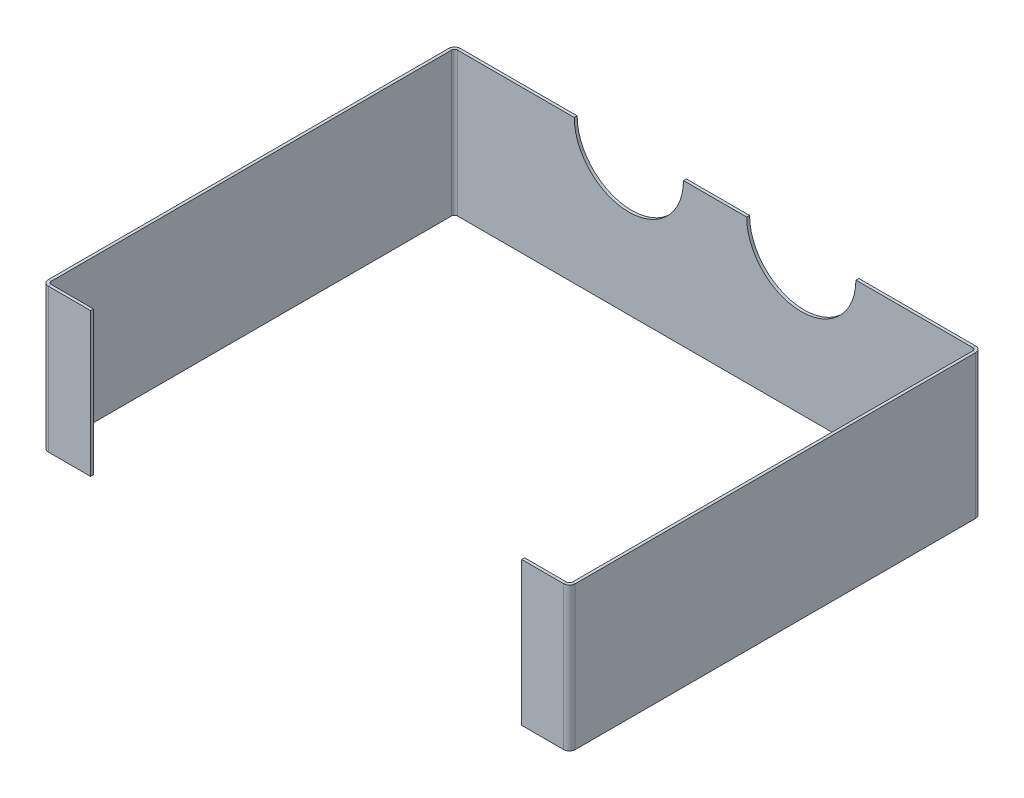
ISO-10303-21;
HEADER;
FILE_DESCRIPTION(('STEP AP214'),'2;1');
FILE_NAME('part.step','',(''),(''),'','','');
FILE_SCHEMA(('AUTOMOTIVE_DESIGN { 1 0 10303 214 1 1 1 1 }'));
ENDSEC;
DATA;
#1=APPLICATION_CONTEXT('core data for automotive mechanical design processes');
#2=APPLICATION_PROTOCOL_DEFINITION('international standard','automotive_design',2000,#1);
#3=PRODUCT_CONTEXT('',#1,'mechanical');
#4=PRODUCT('Part','Part','',(#3));
#5=PRODUCT_RELATED_PRODUCT_CATEGORY('part','',(#4));
#6=PRODUCT_DEFINITION_FORMATION('','',#4);
#7=PRODUCT_DEFINITION_CONTEXT('part definition',#1,'design');
#8=PRODUCT_DEFINITION('design','',#6,#7);
#9=PRODUCT_DEFINITION_SHAPE('','',#8);
#10=(LENGTH_UNIT() NAMED_UNIT(*) SI_UNIT(.MILLI.,.METRE.));
#11=(NAMED_UNIT(*) PLANE_ANGLE_UNIT() SI_UNIT($,.RADIAN.));
#12=(NAMED_UNIT(*) SI_UNIT($,.STERADIAN.) SOLID_ANGLE_UNIT());
#13=UNCERTAINTY_MEASURE_WITH_UNIT(LENGTH_MEASURE(1.E-05),#10,'distance_accuracy_value','');
#14=(GEOMETRIC_REPRESENTATION_CONTEXT(3) GLOBAL_UNCERTAINTY_ASSIGNED_CONTEXT((#13)) GLOBAL_UNIT_ASSIGNED_CONTEXT((#10,
#11,#12)) REPRESENTATION_CONTEXT('',''));
#15=CARTESIAN_POINT('',(0.,0.,0.));
#16=DIRECTION('',(0.,0.,1.));
#17=DIRECTION('',(1.,0.,0.));
#18=AXIS2_PLACEMENT_3D('',#15,#16,#17);
#19=CARTESIAN_POINT('',(-89.9999999999999,75.,-3.));
#20=DIRECTION('',(0.,0.,1.));
#21=DIRECTION('',(1.,0.,0.));
#22=AXIS2_PLACEMENT_3D('',#19,#20,#21);
#23=PLANE('',#22);
#24=DIRECTION('',(0.,-1.,0.));
#25=VECTOR('',#24,1.);
#26=CARTESIAN_POINT('',(269.,74.9999999999998,-2.99999999999993));
#27=LINE('',#26,#25);
#28=CARTESIAN_POINT('',(269.,74.9999999999998,-2.99999999999993));
#29=VERTEX_POINT('',#28);
#30=CARTESIAN_POINT('',(269.,-75.0000000000002,-2.99999999999994));
#31=VERTEX_POINT('',#30);
#32=EDGE_CURVE('E507',#29,#31,#27,.T.);
#33=ORIENTED_EDGE('',*,*,#32,.T.);
#34=DIRECTION('',(1.,0.,0.));
#35=VECTOR('',#34,1.);
#36=CARTESIAN_POINT('',(-275.,-75.,-3.));
#37=LINE('',#36,#35);
#38=CARTESIAN_POINT('',(-269.,-75.,-2.99999999999999));
#39=VERTEX_POINT('',#38);
#40=EDGE_CURVE('E460',#39,#31,#37,.T.);
#41=ORIENTED_EDGE('',*,*,#40,.F.);
#42=DIRECTION('',(0.,1.,0.));
#43=VECTOR('',#42,1.);
#44=CARTESIAN_POINT('',(-269.,-75.,-2.99999999999999));
#45=LINE('',#44,#43);
#46=CARTESIAN_POINT('',(-269.,75.,-2.99999999999999));
#47=VERTEX_POINT('',#46);
#48=EDGE_CURVE('E479',#39,#47,#45,.T.);
#49=ORIENTED_EDGE('',*,*,#48,.T.);
#50=DIRECTION('',(-1.,0.,0.));
#51=VECTOR('',#50,1.);
#52=CARTESIAN_POINT('',(-275.,75.,-3.));
#53=LINE('',#52,#51);
#54=CARTESIAN_POINT('',(-147.,75.,-3.));
#55=VERTEX_POINT('',#54);
#56=EDGE_CURVE('E457',#55,#47,#53,.T.);
#57=ORIENTED_EDGE('',*,*,#56,.F.);
#58=CARTESIAN_POINT('',(-89.9999999999999,75.,-3.));
#59=DIRECTION('',(0.,0.,-1.));
#60=DIRECTION('',(1.,0.,0.));
#61=AXIS2_PLACEMENT_3D('',#58,#59,#60);
#62=CIRCLE('',#61,57.);
#63=CARTESIAN_POINT('',(-32.9999999999999,75.,-3.));
#64=VERTEX_POINT('',#63);
#65=EDGE_CURVE('E454',#64,#55,#62,.T.);
#66=ORIENTED_EDGE('',*,*,#65,.F.);
#67=DIRECTION('',(-1.,0.,0.));
#68=VECTOR('',#67,1.);
#69=CARTESIAN_POINT('',(-32.9999999999999,75.,-3.));
#70=LINE('',#69,#68);
#71=CARTESIAN_POINT('',(33.0000000000002,75.,-3.));
#72=VERTEX_POINT('',#71);
#73=EDGE_CURVE('E451',#72,#64,#70,.T.);
#74=ORIENTED_EDGE('',*,*,#73,.F.);
#75=CARTESIAN_POINT('',(90.0000000000002,75.,-3.));
#76=DIRECTION('',(0.,0.,-1.));
#77=DIRECTION('',(-1.,0.,0.));
#78=AXIS2_PLACEMENT_3D('',#75,#76,#77);
#79=CIRCLE('',#78,57.);
#80=CARTESIAN_POINT('',(147.,75.,-3.));
#81=VERTEX_POINT('',#80);
#82=EDGE_CURVE('E447',#81,#72,#79,.T.);
#83=ORIENTED_EDGE('',*,*,#82,.F.);
#84=DIRECTION('',(-1.,0.,0.));
#85=VECTOR('',#84,1.);
#86=CARTESIAN_POINT('',(147.,75.,-3.));
#87=LINE('',#86,#85);
#88=EDGE_CURVE('E445',#29,#81,#87,.T.);
#89=ORIENTED_EDGE('',*,*,#88,.F.);
#90=EDGE_LOOP('',(#33,#41,#49,#57,#66,#74,#83,#89));
#91=FACE_BOUND('',#90,.T.);
#92=ADVANCED_FACE('F131',(#91),#23,.F.);
#93=CARTESIAN_POINT('',(-89.9999999999999,75.,0.));
#94=DIRECTION('',(0.,0.,1.));
#95=DIRECTION('',(1.,0.,0.));
#96=AXIS2_PLACEMENT_3D('',#93,#94,#95);
#97=PLANE('',#96);
#98=DIRECTION('',(1.,0.,0.));
#99=VECTOR('',#98,1.);
#100=CARTESIAN_POINT('',(-275.,-75.,0.));
#101=LINE('',#100,#99);
#102=CARTESIAN_POINT('',(-269.,-75.,0.));
#103=VERTEX_POINT('',#102);
#104=CARTESIAN_POINT('',(269.,-75.0000000000002,0.));
#105=VERTEX_POINT('',#104);
#106=EDGE_CURVE('E448',#103,#105,#101,.T.);
#107=ORIENTED_EDGE('',*,*,#106,.T.);
#108=DIRECTION('',(0.,-1.,0.));
#109=VECTOR('',#108,1.);
#110=CARTESIAN_POINT('',(269.,74.9999999999998,0.));
#111=LINE('',#110,#109);
#112=CARTESIAN_POINT('',(269.,74.9999999999998,0.));
#113=VERTEX_POINT('',#112);
#114=EDGE_CURVE('E512',#113,#105,#111,.T.);
#115=ORIENTED_EDGE('',*,*,#114,.F.);
#116=DIRECTION('',(-1.,0.,0.));
#117=VECTOR('',#116,1.);
#118=CARTESIAN_POINT('',(147.,75.,0.));
#119=LINE('',#118,#117);
#120=CARTESIAN_POINT('',(147.,75.,0.));
#121=VERTEX_POINT('',#120);
#122=EDGE_CURVE('E440',#113,#121,#119,.T.);
#123=ORIENTED_EDGE('',*,*,#122,.T.);
#124=CARTESIAN_POINT('',(90.0000000000002,75.,0.));
#125=DIRECTION('',(0.,0.,-1.));
#126=DIRECTION('',(-1.,0.,0.));
#127=AXIS2_PLACEMENT_3D('',#124,#125,#126);
#128=CIRCLE('',#127,57.);
#129=CARTESIAN_POINT('',(33.0000000000002,75.,0.));
#130=VERTEX_POINT('',#129);
#131=EDGE_CURVE('E465',#121,#130,#128,.T.);
#132=ORIENTED_EDGE('',*,*,#131,.T.);
#133=DIRECTION('',(-1.,0.,0.));
#134=VECTOR('',#133,1.);
#135=CARTESIAN_POINT('',(-32.9999999999999,75.,0.));
#136=LINE('',#135,#134);
#137=CARTESIAN_POINT('',(-32.9999999999999,75.,0.));
#138=VERTEX_POINT('',#137);
#139=EDGE_CURVE('E468',#130,#138,#136,.T.);
#140=ORIENTED_EDGE('',*,*,#139,.T.);
#141=CARTESIAN_POINT('',(-89.9999999999999,75.,0.));
#142=DIRECTION('',(0.,0.,-1.));
#143=DIRECTION('',(1.,0.,0.));
#144=AXIS2_PLACEMENT_3D('',#141,#142,#143);
#145=CIRCLE('',#144,57.);
#146=CARTESIAN_POINT('',(-147.,75.,0.));
#147=VERTEX_POINT('',#146);
#148=EDGE_CURVE('E471',#138,#147,#145,.T.);
#149=ORIENTED_EDGE('',*,*,#148,.T.);
#150=DIRECTION('',(-1.,0.,0.));
#151=VECTOR('',#150,1.);
#152=CARTESIAN_POINT('',(-275.,75.,0.));
#153=LINE('',#152,#151);
#154=CARTESIAN_POINT('',(-269.,75.,0.));
#155=VERTEX_POINT('',#154);
#156=EDGE_CURVE('E474',#147,#155,#153,.T.);
#157=ORIENTED_EDGE('',*,*,#156,.T.);
#158=DIRECTION('',(0.,1.,0.));
#159=VECTOR('',#158,1.);
#160=CARTESIAN_POINT('',(-269.,-75.,0.));
#161=LINE('',#160,#159);
#162=EDGE_CURVE('E490',#103,#155,#161,.T.);
#163=ORIENTED_EDGE('',*,*,#162,.F.);
#164=EDGE_LOOP('',(#107,#115,#123,#132,#140,#149,#157,#163));
#165=FACE_BOUND('',#164,.T.);
#166=ADVANCED_FACE('F563',(#165),#97,.T.);
#167=CARTESIAN_POINT('',(147.,75.,-3.));
#168=DIRECTION('',(0.,1.,0.));
#169=DIRECTION('',(0.,0.,1.));
#170=AXIS2_PLACEMENT_3D('',#167,#168,#169);
#171=PLANE('',#170);
#172=ORIENTED_EDGE('',*,*,#122,.F.);
#173=DIRECTION('',(0.,0.,-1.));
#174=VECTOR('',#173,1.);
#175=CARTESIAN_POINT('',(269.,74.9999999999998,0.));
#176=LINE('',#175,#174);
#177=EDGE_CURVE('E509',#113,#29,#176,.T.);
#178=ORIENTED_EDGE('',*,*,#177,.T.);
#179=ORIENTED_EDGE('',*,*,#88,.T.);
#180=DIRECTION('',(0.,0.,1.));
#181=VECTOR('',#180,1.);
#182=CARTESIAN_POINT('',(147.,75.,-3.));
#183=LINE('',#182,#181);
#184=EDGE_CURVE('E463',#81,#121,#183,.T.);
#185=ORIENTED_EDGE('',*,*,#184,.T.);
#186=EDGE_LOOP('',(#172,#178,#179,#185));
#187=FACE_BOUND('',#186,.T.);
#188=ADVANCED_FACE('F133',(#187),#171,.T.);
#189=CARTESIAN_POINT('',(-275.,-75.,-3.));
#190=DIRECTION('',(0.,-1.,0.));
#191=DIRECTION('',(0.,0.,-1.));
#192=AXIS2_PLACEMENT_3D('',#189,#190,#191);
#193=PLANE('',#192);
#194=DIRECTION('',(0.,0.,-1.));
#195=VECTOR('',#194,1.);
#196=CARTESIAN_POINT('',(269.,-75.0000000000002,0.));
#197=LINE('',#196,#195);
#198=EDGE_CURVE('E515',#105,#31,#197,.T.);
#199=ORIENTED_EDGE('',*,*,#198,.F.);
#200=ORIENTED_EDGE('',*,*,#106,.F.);
#201=DIRECTION('',(0.,0.,-1.));
#202=VECTOR('',#201,1.);
#203=CARTESIAN_POINT('',(-269.,-75.,0.));
#204=LINE('',#203,#202);
#205=EDGE_CURVE('E487',#103,#39,#204,.T.);
#206=ORIENTED_EDGE('',*,*,#205,.T.);
#207=ORIENTED_EDGE('',*,*,#40,.T.);
#208=EDGE_LOOP('',(#199,#200,#206,#207));
#209=FACE_BOUND('',#208,.T.);
#210=ADVANCED_FACE('F577',(#209),#193,.T.);
#211=CARTESIAN_POINT('',(-275.,75.,-3.));
#212=DIRECTION('',(0.,1.,0.));
#213=DIRECTION('',(0.,0.,1.));
#214=AXIS2_PLACEMENT_3D('',#211,#212,#213);
#215=PLANE('',#214);
#216=DIRECTION('',(0.,0.,-1.));
#217=VECTOR('',#216,1.);
#218=CARTESIAN_POINT('',(-269.,75.,0.));
#219=LINE('',#218,#217);
#220=EDGE_CURVE('E493',#155,#47,#219,.T.);
#221=ORIENTED_EDGE('',*,*,#220,.F.);
#222=ORIENTED_EDGE('',*,*,#156,.F.);
#223=DIRECTION('',(0.,0.,1.));
#224=VECTOR('',#223,1.);
#225=CARTESIAN_POINT('',(-147.,75.,-3.));
#226=LINE('',#225,#224);
#227=EDGE_CURVE('E477',#55,#147,#226,.T.);
#228=ORIENTED_EDGE('',*,*,#227,.F.);
#229=ORIENTED_EDGE('',*,*,#56,.T.);
#230=EDGE_LOOP('',(#221,#222,#228,#229));
#231=FACE_BOUND('',#230,.T.);
#232=ADVANCED_FACE('F664',(#231),#215,.T.);
#233=CARTESIAN_POINT('',(-89.9999999999999,75.,-3.));
#234=DIRECTION('',(0.,0.,1.));
#235=DIRECTION('',(1.,0.,0.));
#236=AXIS2_PLACEMENT_3D('',#233,#234,#235);
#237=CYLINDRICAL_SURFACE('',#236,57.);
#238=ORIENTED_EDGE('',*,*,#148,.F.);
#239=DIRECTION('',(0.,0.,1.));
#240=VECTOR('',#239,1.);
#241=CARTESIAN_POINT('',(-32.9999999999999,75.,-3.));
#242=LINE('',#241,#240);
#243=EDGE_CURVE('E480',#64,#138,#242,.T.);
#244=ORIENTED_EDGE('',*,*,#243,.F.);
#245=ORIENTED_EDGE('',*,*,#65,.T.);
#246=ORIENTED_EDGE('',*,*,#227,.T.);
#247=EDGE_LOOP('',(#238,#244,#245,#246));
#248=FACE_BOUND('',#247,.T.);
#249=ADVANCED_FACE('F667',(#248),#237,.F.);
#250=CARTESIAN_POINT('',(-32.9999999999999,75.,-3.));
#251=DIRECTION('',(0.,1.,0.));
#252=DIRECTION('',(0.,0.,1.));
#253=AXIS2_PLACEMENT_3D('',#250,#251,#252);
#254=PLANE('',#253);
#255=ORIENTED_EDGE('',*,*,#139,.F.);
#256=DIRECTION('',(0.,0.,1.));
#257=VECTOR('',#256,1.);
#258=CARTESIAN_POINT('',(33.0000000000002,75.,-3.));
#259=LINE('',#258,#257);
#260=EDGE_CURVE('E482',#72,#130,#259,.T.);
#261=ORIENTED_EDGE('',*,*,#260,.F.);
#262=ORIENTED_EDGE('',*,*,#73,.T.);
#263=ORIENTED_EDGE('',*,*,#243,.T.);
#264=EDGE_LOOP('',(#255,#261,#262,#263));
#265=FACE_BOUND('',#264,.T.);
#266=ADVANCED_FACE('F671',(#265),#254,.T.);
#267=CARTESIAN_POINT('',(90.0000000000002,75.,-3.));
#268=DIRECTION('',(0.,0.,1.));
#269=DIRECTION('',(1.,0.,0.));
#270=AXIS2_PLACEMENT_3D('',#267,#268,#269);
#271=CYLINDRICAL_SURFACE('',#270,57.);
#272=ORIENTED_EDGE('',*,*,#131,.F.);
#273=ORIENTED_EDGE('',*,*,#184,.F.);
#274=ORIENTED_EDGE('',*,*,#82,.T.);
#275=ORIENTED_EDGE('',*,*,#260,.T.);
#276=EDGE_LOOP('',(#272,#273,#274,#275));
#277=FACE_BOUND('',#276,.T.);
#278=ADVANCED_FACE('F674',(#277),#271,.F.);
#279=CARTESIAN_POINT('',(-269.,75.,3.00000000000001));
#280=DIRECTION('',(0.,1.,0.));
#281=DIRECTION('',(0.,0.,1.));
#282=AXIS2_PLACEMENT_3D('',#279,#280,#281);
#283=PLANE('',#282);
#284=DIRECTION('',(-1.,0.,0.));
#285=VECTOR('',#284,1.);
#286=CARTESIAN_POINT('',(-275.,75.,3.00000000000006));
#287=LINE('',#286,#285);
#288=CARTESIAN_POINT('',(-272.,75.,3.00000000000006));
#289=VERTEX_POINT('',#288);
#290=CARTESIAN_POINT('',(-275.,75.,3.00000000000002));
#291=VERTEX_POINT('',#290);
#292=EDGE_CURVE('E413',#289,#291,#287,.T.);
#293=ORIENTED_EDGE('',*,*,#292,.F.);
#294=CARTESIAN_POINT('',(-269.,75.,3.00000000000001));
#295=DIRECTION('',(0.,1.,0.));
#296=DIRECTION('',(0.,0.,1.));
#297=AXIS2_PLACEMENT_3D('',#294,#295,#296);
#298=CIRCLE('',#297,3.);
#299=EDGE_CURVE('E415',#289,#155,#298,.F.);
#300=ORIENTED_EDGE('',*,*,#299,.T.);
#301=ORIENTED_EDGE('',*,*,#220,.T.);
#302=CARTESIAN_POINT('',(-269.,75.,3.00000000000001));
#303=DIRECTION('',(0.,-1.,0.));
#304=DIRECTION('',(0.,0.,-1.));
#305=AXIS2_PLACEMENT_3D('',#302,#303,#304);
#306=CIRCLE('',#305,6.);
#307=EDGE_CURVE('E433',#291,#47,#306,.T.);
#308=ORIENTED_EDGE('',*,*,#307,.F.);
#309=EDGE_LOOP('',(#293,#300,#301,#308));
#310=FACE_BOUND('',#309,.T.);
#311=ADVANCED_FACE('F602',(#310),#283,.T.);
#312=CARTESIAN_POINT('',(-269.,-75.,3.00000000000001));
#313=DIRECTION('',(0.,-1.,0.));
#314=DIRECTION('',(0.,0.,-1.));
#315=AXIS2_PLACEMENT_3D('',#312,#313,#314);
#316=PLANE('',#315);
#317=CARTESIAN_POINT('',(-269.,-75.,3.00000000000001));
#318=DIRECTION('',(0.,1.,0.));
#319=DIRECTION('',(0.,0.,1.));
#320=AXIS2_PLACEMENT_3D('',#317,#318,#319);
#321=CIRCLE('',#320,3.);
#322=CARTESIAN_POINT('',(-272.,-75.,3.00000000000006));
#323=VERTEX_POINT('',#322);
#324=EDGE_CURVE('E437',#103,#323,#321,.T.);
#325=ORIENTED_EDGE('',*,*,#324,.T.);
#326=DIRECTION('',(-1.,0.,0.));
#327=VECTOR('',#326,1.);
#328=CARTESIAN_POINT('',(-272.,-75.,3.00000000000006));
#329=LINE('',#328,#327);
#330=CARTESIAN_POINT('',(-275.,-75.,3.00000000000006));
#331=VERTEX_POINT('',#330);
#332=EDGE_CURVE('E425',#323,#331,#329,.T.);
#333=ORIENTED_EDGE('',*,*,#332,.T.);
#334=CARTESIAN_POINT('',(-269.,-75.,3.00000000000001));
#335=DIRECTION('',(0.,1.,0.));
#336=DIRECTION('',(0.,0.,1.));
#337=AXIS2_PLACEMENT_3D('',#334,#335,#336);
#338=CIRCLE('',#337,6.);
#339=EDGE_CURVE('E436',#39,#331,#338,.T.);
#340=ORIENTED_EDGE('',*,*,#339,.F.);
#341=ORIENTED_EDGE('',*,*,#205,.F.);
#342=EDGE_LOOP('',(#325,#333,#340,#341));
#343=FACE_BOUND('',#342,.T.);
#344=ADVANCED_FACE('F587',(#343),#316,.T.);
#345=CARTESIAN_POINT('',(-269.,-150.196420970276,3.00000000000001));
#346=DIRECTION('',(0.,1.,0.));
#347=DIRECTION('',(0.,0.,1.));
#348=AXIS2_PLACEMENT_3D('',#345,#346,#347);
#349=CYLINDRICAL_SURFACE('',#348,6.);
#350=ORIENTED_EDGE('',*,*,#48,.F.);
#351=ORIENTED_EDGE('',*,*,#339,.T.);
#352=DIRECTION('',(0.,1.,0.));
#353=VECTOR('',#352,1.);
#354=CARTESIAN_POINT('',(-275.,75.,3.00000000000006));
#355=LINE('',#354,#353);
#356=EDGE_CURVE('E408',#331,#291,#355,.T.);
#357=ORIENTED_EDGE('',*,*,#356,.T.);
#358=ORIENTED_EDGE('',*,*,#307,.T.);
#359=EDGE_LOOP('',(#350,#351,#357,#358));
#360=FACE_BOUND('',#359,.T.);
#361=ADVANCED_FACE('F584',(#360),#349,.T.);
#362=CARTESIAN_POINT('',(-269.,-150.196420970276,3.00000000000001));
#363=DIRECTION('',(0.,1.,0.));
#364=DIRECTION('',(0.,0.,1.));
#365=AXIS2_PLACEMENT_3D('',#362,#363,#364);
#366=CYLINDRICAL_SURFACE('',#365,3.);
#367=ORIENTED_EDGE('',*,*,#162,.T.);
#368=ORIENTED_EDGE('',*,*,#299,.F.);
#369=DIRECTION('',(0.,-1.,0.));
#370=VECTOR('',#369,1.);
#371=CARTESIAN_POINT('',(-272.,75.,3.00000000000006));
#372=LINE('',#371,#370);
#373=EDGE_CURVE('E428',#289,#323,#372,.T.);
#374=ORIENTED_EDGE('',*,*,#373,.T.);
#375=ORIENTED_EDGE('',*,*,#324,.F.);
#376=EDGE_LOOP('',(#367,#368,#374,#375));
#377=FACE_BOUND('',#376,.T.);
#378=ADVANCED_FACE('F596',(#377),#366,.F.);
#379=CARTESIAN_POINT('',(-275.,0.,-9.43689570931383E-13));
#380=DIRECTION('',(1.,0.,0.));
#381=DIRECTION('',(0.,0.,-1.));
#382=AXIS2_PLACEMENT_3D('',#379,#380,#381);
#383=PLANE('',#382);
#384=DIRECTION('',(0.,1.,0.));
#385=VECTOR('',#384,1.);
#386=CARTESIAN_POINT('',(-275.000000000001,-75.,421.));
#387=LINE('',#386,#385);
#388=CARTESIAN_POINT('',(-275.000000000001,-75.,421.));
#389=VERTEX_POINT('',#388);
#390=CARTESIAN_POINT('',(-275.000000000001,75.,421.));
#391=VERTEX_POINT('',#390);
#392=EDGE_CURVE('E496',#389,#391,#387,.T.);
#393=ORIENTED_EDGE('',*,*,#392,.T.);
#394=DIRECTION('',(0.,0.,-1.));
#395=VECTOR('',#394,1.);
#396=CARTESIAN_POINT('',(-275.,75.,-9.43689570931383E-13));
#397=LINE('',#396,#395);
#398=EDGE_CURVE('E422',#391,#291,#397,.T.);
#399=ORIENTED_EDGE('',*,*,#398,.T.);
#400=ORIENTED_EDGE('',*,*,#356,.F.);
#401=DIRECTION('',(0.,0.,1.));
#402=VECTOR('',#401,1.);
#403=CARTESIAN_POINT('',(-275.,-75.,-9.43689570931383E-13));
#404=LINE('',#403,#402);
#405=EDGE_CURVE('E420',#331,#389,#404,.T.);
#406=ORIENTED_EDGE('',*,*,#405,.T.);
#407=EDGE_LOOP('',(#393,#399,#400,#406));
#408=FACE_BOUND('',#407,.T.);
#409=ADVANCED_FACE('F607',(#408),#383,.F.);
#410=CARTESIAN_POINT('',(-275.000000000001,-75.,427.));
#411=DIRECTION('',(0.,1.,0.));
#412=DIRECTION('',(0.,0.,1.));
#413=AXIS2_PLACEMENT_3D('',#410,#411,#412);
#414=PLANE('',#413);
#415=DIRECTION('',(-1.,0.,0.));
#416=VECTOR('',#415,1.);
#417=CARTESIAN_POINT('',(-272.000000000001,-75.,421.));
#418=LINE('',#417,#416);
#419=CARTESIAN_POINT('',(-272.000000000001,-75.,421.));
#420=VERTEX_POINT('',#419);
#421=EDGE_CURVE('E498',#420,#389,#418,.T.);
#422=ORIENTED_EDGE('',*,*,#421,.T.);
#423=ORIENTED_EDGE('',*,*,#405,.F.);
#424=ORIENTED_EDGE('',*,*,#332,.F.);
#425=DIRECTION('',(0.,0.,-1.));
#426=VECTOR('',#425,1.);
#427=CARTESIAN_POINT('',(-272.000000000001,-75.,427.));
#428=LINE('',#427,#426);
#429=EDGE_CURVE('E418',#323,#420,#428,.F.);
#430=ORIENTED_EDGE('',*,*,#429,.T.);
#431=EDGE_LOOP('',(#422,#423,#424,#430));
#432=FACE_BOUND('',#431,.T.);
#433=ADVANCED_FACE('F591',(#432),#414,.F.);
#434=CARTESIAN_POINT('',(-272.,0.,-8.88178419700125E-13));
#435=DIRECTION('',(1.,0.,0.));
#436=DIRECTION('',(0.,0.,-1.));
#437=AXIS2_PLACEMENT_3D('',#434,#435,#436);
#438=PLANE('',#437);
#439=DIRECTION('',(0.,0.,1.));
#440=VECTOR('',#439,1.);
#441=CARTESIAN_POINT('',(-272.,75.,0.));
#442=LINE('',#441,#440);
#443=CARTESIAN_POINT('',(-272.000000000001,75.,421.));
#444=VERTEX_POINT('',#443);
#445=EDGE_CURVE('E416',#444,#289,#442,.F.);
#446=ORIENTED_EDGE('',*,*,#445,.F.);
#447=DIRECTION('',(0.,1.,0.));
#448=VECTOR('',#447,1.);
#449=CARTESIAN_POINT('',(-272.000000000001,-75.,421.));
#450=LINE('',#449,#448);
#451=EDGE_CURVE('E501',#420,#444,#450,.T.);
#452=ORIENTED_EDGE('',*,*,#451,.F.);
#453=ORIENTED_EDGE('',*,*,#429,.F.);
#454=ORIENTED_EDGE('',*,*,#373,.F.);
#455=EDGE_LOOP('',(#446,#452,#453,#454));
#456=FACE_BOUND('',#455,.T.);
#457=ADVANCED_FACE('F599',(#456),#438,.T.);
#458=CARTESIAN_POINT('',(-275.,75.,0.));
#459=DIRECTION('',(0.,-1.,0.));
#460=DIRECTION('',(0.,0.,-1.));
#461=AXIS2_PLACEMENT_3D('',#458,#459,#460);
#462=PLANE('',#461);
#463=DIRECTION('',(-1.,0.,0.));
#464=VECTOR('',#463,1.);
#465=CARTESIAN_POINT('',(-272.000000000001,75.,421.));
#466=LINE('',#465,#464);
#467=EDGE_CURVE('E504',#444,#391,#466,.T.);
#468=ORIENTED_EDGE('',*,*,#467,.F.);
#469=ORIENTED_EDGE('',*,*,#445,.T.);
#470=ORIENTED_EDGE('',*,*,#292,.T.);
#471=ORIENTED_EDGE('',*,*,#398,.F.);
#472=EDGE_LOOP('',(#468,#469,#470,#471));
#473=FACE_BOUND('',#472,.T.);
#474=ADVANCED_FACE('F605',(#473),#462,.F.);
#475=CARTESIAN_POINT('',(-269.000000000001,75.,421.));
#476=DIRECTION('',(0.,1.,0.));
#477=DIRECTION('',(0.,0.,1.));
#478=AXIS2_PLACEMENT_3D('',#475,#476,#477);
#479=PLANE('',#478);
#480=DIRECTION('',(0.,0.,1.));
#481=VECTOR('',#480,1.);
#482=CARTESIAN_POINT('',(-269.000000000001,75.,427.));
#483=LINE('',#482,#481);
#484=CARTESIAN_POINT('',(-269.000000000001,75.,424.));
#485=VERTEX_POINT('',#484);
#486=CARTESIAN_POINT('',(-269.000000000001,75.,427.));
#487=VERTEX_POINT('',#486);
#488=EDGE_CURVE('E377',#485,#487,#483,.T.);
#489=ORIENTED_EDGE('',*,*,#488,.F.);
#490=CARTESIAN_POINT('',(-269.000000000001,75.,421.));
#491=DIRECTION('',(0.,1.,0.));
#492=DIRECTION('',(0.,0.,1.));
#493=AXIS2_PLACEMENT_3D('',#490,#491,#492);
#494=CIRCLE('',#493,3.);
#495=EDGE_CURVE('E373',#485,#444,#494,.F.);
#496=ORIENTED_EDGE('',*,*,#495,.T.);
#497=ORIENTED_EDGE('',*,*,#467,.T.);
#498=CARTESIAN_POINT('',(-269.000000000001,75.,421.));
#499=DIRECTION('',(0.,-1.,0.));
#500=DIRECTION('',(0.,0.,-1.));
#501=AXIS2_PLACEMENT_3D('',#498,#499,#500);
#502=CIRCLE('',#501,6.00000000000001);
#503=EDGE_CURVE('E401',#487,#391,#502,.T.);
#504=ORIENTED_EDGE('',*,*,#503,.F.);
#505=EDGE_LOOP('',(#489,#496,#497,#504));
#506=FACE_BOUND('',#505,.T.);
#507=ADVANCED_FACE('F632',(#506),#479,.T.);
#508=CARTESIAN_POINT('',(-269.000000000001,-75.,421.));
#509=DIRECTION('',(0.,-1.,0.));
#510=DIRECTION('',(0.,0.,-1.));
#511=AXIS2_PLACEMENT_3D('',#508,#509,#510);
#512=PLANE('',#511);
#513=CARTESIAN_POINT('',(-269.000000000001,-75.,421.));
#514=DIRECTION('',(0.,1.,0.));
#515=DIRECTION('',(0.,0.,1.));
#516=AXIS2_PLACEMENT_3D('',#513,#514,#515);
#517=CIRCLE('',#516,3.);
#518=CARTESIAN_POINT('',(-269.000000000001,-75.,424.));
#519=VERTEX_POINT('',#518);
#520=EDGE_CURVE('E405',#420,#519,#517,.T.);
#521=ORIENTED_EDGE('',*,*,#520,.T.);
#522=DIRECTION('',(0.,0.,1.));
#523=VECTOR('',#522,1.);
#524=CARTESIAN_POINT('',(-269.000000000001,-75.,424.));
#525=LINE('',#524,#523);
#526=CARTESIAN_POINT('',(-269.000000000001,-75.,427.));
#527=VERTEX_POINT('',#526);
#528=EDGE_CURVE('E393',#519,#527,#525,.T.);
#529=ORIENTED_EDGE('',*,*,#528,.T.);
#530=CARTESIAN_POINT('',(-269.000000000001,-75.,421.));
#531=DIRECTION('',(0.,1.,0.));
#532=DIRECTION('',(0.,0.,1.));
#533=AXIS2_PLACEMENT_3D('',#530,#531,#532);
#534=CIRCLE('',#533,6.00000000000001);
#535=EDGE_CURVE('E404',#389,#527,#534,.T.);
#536=ORIENTED_EDGE('',*,*,#535,.F.);
#537=ORIENTED_EDGE('',*,*,#421,.F.);
#538=EDGE_LOOP('',(#521,#529,#536,#537));
#539=FACE_BOUND('',#538,.T.);
#540=ADVANCED_FACE('F615',(#539),#512,.T.);
#541=CARTESIAN_POINT('',(-269.000000000001,-150.196420970276,421.));
#542=DIRECTION('',(0.,1.,0.));
#543=DIRECTION('',(0.,0.,1.));
#544=AXIS2_PLACEMENT_3D('',#541,#542,#543);
#545=CYLINDRICAL_SURFACE('',#544,6.);
#546=ORIENTED_EDGE('',*,*,#392,.F.);
#547=ORIENTED_EDGE('',*,*,#535,.T.);
#548=DIRECTION('',(0.,1.,0.));
#549=VECTOR('',#548,1.);
#550=CARTESIAN_POINT('',(-269.000000000001,75.,427.));
#551=LINE('',#550,#549);
#552=EDGE_CURVE('E366',#527,#487,#551,.T.);
#553=ORIENTED_EDGE('',*,*,#552,.T.);
#554=ORIENTED_EDGE('',*,*,#503,.T.);
#555=EDGE_LOOP('',(#546,#547,#553,#554));
#556=FACE_BOUND('',#555,.T.);
#557=ADVANCED_FACE('F611',(#556),#545,.T.);
#558=CARTESIAN_POINT('',(-269.000000000001,-150.196420970276,421.));
#559=DIRECTION('',(0.,1.,0.));
#560=DIRECTION('',(0.,0.,1.));
#561=AXIS2_PLACEMENT_3D('',#558,#559,#560);
#562=CYLINDRICAL_SURFACE('',#561,3.);
#563=ORIENTED_EDGE('',*,*,#451,.T.);
#564=ORIENTED_EDGE('',*,*,#495,.F.);
#565=DIRECTION('',(0.,-1.,0.));
#566=VECTOR('',#565,1.);
#567=CARTESIAN_POINT('',(-269.000000000001,75.,424.));
#568=LINE('',#567,#566);
#569=EDGE_CURVE('E396',#485,#519,#568,.T.);
#570=ORIENTED_EDGE('',*,*,#569,.T.);
#571=ORIENTED_EDGE('',*,*,#520,.F.);
#572=EDGE_LOOP('',(#563,#564,#570,#571));
#573=FACE_BOUND('',#572,.T.);
#574=ADVANCED_FACE('F626',(#573),#562,.F.);
#575=CARTESIAN_POINT('',(-225.000000000002,75.,427.));
#576=DIRECTION('',(-1.,0.,0.));
#577=DIRECTION('',(0.,0.,1.));
#578=AXIS2_PLACEMENT_3D('',#575,#576,#577);
#579=PLANE('',#578);
#580=DIRECTION('',(0.,-1.,0.));
#581=VECTOR('',#580,1.);
#582=CARTESIAN_POINT('',(-225.000000000001,75.,424.));
#583=LINE('',#582,#581);
#584=CARTESIAN_POINT('',(-225.000000000001,-75.,424.));
#585=VERTEX_POINT('',#584);
#586=CARTESIAN_POINT('',(-225.000000000001,75.,424.));
#587=VERTEX_POINT('',#586);
#588=EDGE_CURVE('E391',#585,#587,#583,.F.);
#589=ORIENTED_EDGE('',*,*,#588,.T.);
#590=DIRECTION('',(0.,0.,-1.));
#591=VECTOR('',#590,1.);
#592=CARTESIAN_POINT('',(-225.000000000002,75.,427.));
#593=LINE('',#592,#591);
#594=CARTESIAN_POINT('',(-225.000000000002,75.,427.));
#595=VERTEX_POINT('',#594);
#596=EDGE_CURVE('E374',#595,#587,#593,.T.);
#597=ORIENTED_EDGE('',*,*,#596,.F.);
#598=DIRECTION('',(0.,1.,0.));
#599=VECTOR('',#598,1.);
#600=CARTESIAN_POINT('',(-225.000000000002,0.,427.));
#601=LINE('',#600,#599);
#602=CARTESIAN_POINT('',(-225.000000000002,-75.,427.));
#603=VERTEX_POINT('',#602);
#604=EDGE_CURVE('E384',#603,#595,#601,.T.);
#605=ORIENTED_EDGE('',*,*,#604,.F.);
#606=DIRECTION('',(0.,0.,-1.));
#607=VECTOR('',#606,1.);
#608=CARTESIAN_POINT('',(-225.000000000002,-75.,427.));
#609=LINE('',#608,#607);
#610=EDGE_CURVE('E388',#603,#585,#609,.T.);
#611=ORIENTED_EDGE('',*,*,#610,.T.);
#612=EDGE_LOOP('',(#589,#597,#605,#611));
#613=FACE_BOUND('',#612,.T.);
#614=ADVANCED_FACE('F641',(#613),#579,.F.);
#615=CARTESIAN_POINT('',(-3.10862446895044E-12,0.,427.000000000002));
#616=DIRECTION('',(0.,0.,-1.));
#617=DIRECTION('',(-1.,0.,0.));
#618=AXIS2_PLACEMENT_3D('',#615,#616,#617);
#619=PLANE('',#618);
#620=ORIENTED_EDGE('',*,*,#552,.F.);
#621=DIRECTION('',(1.,0.,0.));
#622=VECTOR('',#621,1.);
#623=CARTESIAN_POINT('',(-3.10862446895044E-12,-75.,427.000000000002));
#624=LINE('',#623,#622);
#625=EDGE_CURVE('E386',#527,#603,#624,.T.);
#626=ORIENTED_EDGE('',*,*,#625,.T.);
#627=ORIENTED_EDGE('',*,*,#604,.T.);
#628=DIRECTION('',(-1.,0.,0.));
#629=VECTOR('',#628,1.);
#630=CARTESIAN_POINT('',(-3.10862446895044E-12,75.,427.000000000002));
#631=LINE('',#630,#629);
#632=EDGE_CURVE('E381',#595,#487,#631,.T.);
#633=ORIENTED_EDGE('',*,*,#632,.T.);
#634=EDGE_LOOP('',(#620,#626,#627,#633));
#635=FACE_BOUND('',#634,.T.);
#636=ADVANCED_FACE('F637',(#635),#619,.F.);
#637=CARTESIAN_POINT('',(-225.000000000002,-75.,427.));
#638=DIRECTION('',(0.,1.,0.));
#639=DIRECTION('',(0.,0.,1.));
#640=AXIS2_PLACEMENT_3D('',#637,#638,#639);
#641=PLANE('',#640);
#642=ORIENTED_EDGE('',*,*,#528,.F.);
#643=DIRECTION('',(-1.,0.,0.));
#644=VECTOR('',#643,1.);
#645=CARTESIAN_POINT('',(-225.000000000001,-75.,424.));
#646=LINE('',#645,#644);
#647=EDGE_CURVE('E379',#519,#585,#646,.F.);
#648=ORIENTED_EDGE('',*,*,#647,.T.);
#649=ORIENTED_EDGE('',*,*,#610,.F.);
#650=ORIENTED_EDGE('',*,*,#625,.F.);
#651=EDGE_LOOP('',(#642,#648,#649,#650));
#652=FACE_BOUND('',#651,.T.);
#653=ADVANCED_FACE('F620',(#652),#641,.F.);
#654=CARTESIAN_POINT('',(-2.88657986402541E-12,0.,424.000000000002));
#655=DIRECTION('',(0.,0.,-1.));
#656=DIRECTION('',(-1.,0.,0.));
#657=AXIS2_PLACEMENT_3D('',#654,#655,#656);
#658=PLANE('',#657);
#659=ORIENTED_EDGE('',*,*,#647,.F.);
#660=ORIENTED_EDGE('',*,*,#569,.F.);
#661=DIRECTION('',(1.,0.,0.));
#662=VECTOR('',#661,1.);
#663=CARTESIAN_POINT('',(-272.000000000001,75.,424.));
#664=LINE('',#663,#662);
#665=EDGE_CURVE('E371',#587,#485,#664,.F.);
#666=ORIENTED_EDGE('',*,*,#665,.F.);
#667=ORIENTED_EDGE('',*,*,#588,.F.);
#668=EDGE_LOOP('',(#659,#660,#666,#667));
#669=FACE_BOUND('',#668,.T.);
#670=ADVANCED_FACE('F630',(#669),#658,.T.);
#671=CARTESIAN_POINT('',(-272.000000000001,75.,427.));
#672=DIRECTION('',(0.,-1.,0.));
#673=DIRECTION('',(0.,0.,-1.));
#674=AXIS2_PLACEMENT_3D('',#671,#672,#673);
#675=PLANE('',#674);
#676=ORIENTED_EDGE('',*,*,#488,.T.);
#677=ORIENTED_EDGE('',*,*,#632,.F.);
#678=ORIENTED_EDGE('',*,*,#596,.T.);
#679=ORIENTED_EDGE('',*,*,#665,.T.);
#680=EDGE_LOOP('',(#676,#677,#678,#679));
#681=FACE_BOUND('',#680,.T.);
#682=ADVANCED_FACE('F635',(#681),#675,.F.);
#683=CARTESIAN_POINT('',(269.,-75.0000000000002,3.00000000000007));
#684=DIRECTION('',(0.,-1.,0.));
#685=DIRECTION('',(0.,0.,-1.));
#686=AXIS2_PLACEMENT_3D('',#683,#684,#685);
#687=PLANE('',#686);
#688=DIRECTION('',(1.,0.,0.));
#689=VECTOR('',#688,1.);
#690=CARTESIAN_POINT('',(275.,-75.0000000000002,3.00000000000011));
#691=LINE('',#690,#689);
#692=CARTESIAN_POINT('',(272.,-75.0000000000002,3.00000000000011));
#693=VERTEX_POINT('',#692);
#694=CARTESIAN_POINT('',(275.,-75.0000000000002,3.00000000000007));
#695=VERTEX_POINT('',#694);
#696=EDGE_CURVE('E345',#693,#695,#691,.T.);
#697=ORIENTED_EDGE('',*,*,#696,.F.);
#698=CARTESIAN_POINT('',(269.,-75.0000000000002,3.00000000000007));
#699=DIRECTION('',(0.,-1.,0.));
#700=DIRECTION('',(0.,0.,-1.));
#701=AXIS2_PLACEMENT_3D('',#698,#699,#700);
#702=CIRCLE('',#701,3.);
#703=EDGE_CURVE('E344',#693,#105,#702,.F.);
#704=ORIENTED_EDGE('',*,*,#703,.T.);
#705=ORIENTED_EDGE('',*,*,#198,.T.);
#706=CARTESIAN_POINT('',(269.,-75.0000000000002,3.00000000000007));
#707=DIRECTION('',(0.,1.,0.));
#708=DIRECTION('',(0.,0.,1.));
#709=AXIS2_PLACEMENT_3D('',#706,#707,#708);
#710=CIRCLE('',#709,6.);
#711=EDGE_CURVE('E359',#695,#31,#710,.T.);
#712=ORIENTED_EDGE('',*,*,#711,.F.);
#713=EDGE_LOOP('',(#697,#704,#705,#712));
#714=FACE_BOUND('',#713,.T.);
#715=ADVANCED_FACE('F556',(#714),#687,.T.);
#716=CARTESIAN_POINT('',(269.,74.9999999999998,3.00000000000007));
#717=DIRECTION('',(0.,1.,0.));
#718=DIRECTION('',(0.,0.,1.));
#719=AXIS2_PLACEMENT_3D('',#716,#717,#718);
#720=PLANE('',#719);
#721=CARTESIAN_POINT('',(269.,74.9999999999998,3.00000000000007));
#722=DIRECTION('',(0.,-1.,0.));
#723=DIRECTION('',(0.,0.,-1.));
#724=AXIS2_PLACEMENT_3D('',#721,#722,#723);
#725=CIRCLE('',#724,3.);
#726=CARTESIAN_POINT('',(272.,74.9999999999998,3.00000000000011));
#727=VERTEX_POINT('',#726);
#728=EDGE_CURVE('E363',#113,#727,#725,.T.);
#729=ORIENTED_EDGE('',*,*,#728,.T.);
#730=DIRECTION('',(1.,0.,0.));
#731=VECTOR('',#730,1.);
#732=CARTESIAN_POINT('',(272.,74.9999999999998,3.00000000000011));
#733=LINE('',#732,#731);
#734=CARTESIAN_POINT('',(275.,74.9999999999998,3.00000000000011));
#735=VERTEX_POINT('',#734);
#736=EDGE_CURVE('E351',#727,#735,#733,.T.);
#737=ORIENTED_EDGE('',*,*,#736,.T.);
#738=CARTESIAN_POINT('',(269.,74.9999999999998,3.00000000000007));
#739=DIRECTION('',(0.,-1.,0.));
#740=DIRECTION('',(0.,0.,-1.));
#741=AXIS2_PLACEMENT_3D('',#738,#739,#740);
#742=CIRCLE('',#741,6.);
#743=EDGE_CURVE('E362',#29,#735,#742,.T.);
#744=ORIENTED_EDGE('',*,*,#743,.F.);
#745=ORIENTED_EDGE('',*,*,#177,.F.);
#746=EDGE_LOOP('',(#729,#737,#744,#745));
#747=FACE_BOUND('',#746,.T.);
#748=ADVANCED_FACE('F568',(#747),#720,.T.);
#749=CARTESIAN_POINT('',(269.,150.196420970276,3.00000000000007));
#750=DIRECTION('',(0.,-1.,0.));
#751=DIRECTION('',(0.,0.,-1.));
#752=AXIS2_PLACEMENT_3D('',#749,#750,#751);
#753=CYLINDRICAL_SURFACE('',#752,6.);
#754=ORIENTED_EDGE('',*,*,#32,.F.);
#755=ORIENTED_EDGE('',*,*,#743,.T.);
#756=DIRECTION('',(0.,-1.,0.));
#757=VECTOR('',#756,1.);
#758=CARTESIAN_POINT('',(275.,-75.0000000000002,3.00000000000011));
#759=LINE('',#758,#757);
#760=EDGE_CURVE('E336',#735,#695,#759,.T.);
#761=ORIENTED_EDGE('',*,*,#760,.T.);
#762=ORIENTED_EDGE('',*,*,#711,.T.);
#763=EDGE_LOOP('',(#754,#755,#761,#762));
#764=FACE_BOUND('',#763,.T.);
#765=ADVANCED_FACE('F573',(#764),#753,.T.);
#766=CARTESIAN_POINT('',(269.,150.196420970276,3.00000000000007));
#767=DIRECTION('',(0.,-1.,0.));
#768=DIRECTION('',(0.,0.,-1.));
#769=AXIS2_PLACEMENT_3D('',#766,#767,#768);
#770=CYLINDRICAL_SURFACE('',#769,3.);
#771=ORIENTED_EDGE('',*,*,#114,.T.);
#772=ORIENTED_EDGE('',*,*,#703,.F.);
#773=DIRECTION('',(0.,1.,0.));
#774=VECTOR('',#773,1.);
#775=CARTESIAN_POINT('',(272.,-75.0000000000002,3.00000000000011));
#776=LINE('',#775,#774);
#777=EDGE_CURVE('E354',#693,#727,#776,.T.);
#778=ORIENTED_EDGE('',*,*,#777,.T.);
#779=ORIENTED_EDGE('',*,*,#728,.F.);
#780=EDGE_LOOP('',(#771,#772,#778,#779));
#781=FACE_BOUND('',#780,.T.);
#782=ADVANCED_FACE('F558',(#781),#770,.F.);
#783=CARTESIAN_POINT('',(275.,-2.05761333897196E-13,-8.88178419700125E-13));
#784=DIRECTION('',(-1.,0.,0.));
#785=DIRECTION('',(0.,0.,-1.));
#786=AXIS2_PLACEMENT_3D('',#783,#784,#785);
#787=PLANE('',#786);
#788=DIRECTION('',(0.,-1.,0.));
#789=VECTOR('',#788,1.);
#790=CARTESIAN_POINT('',(275.000000000001,74.9999999999998,421.));
#791=LINE('',#790,#789);
#792=CARTESIAN_POINT('',(275.000000000001,74.9999999999998,421.));
#793=VERTEX_POINT('',#792);
#794=CARTESIAN_POINT('',(275.000000000001,-75.,421.));
#795=VERTEX_POINT('',#794);
#796=EDGE_CURVE('E518',#793,#795,#791,.T.);
#797=ORIENTED_EDGE('',*,*,#796,.T.);
#798=DIRECTION('',(0.,0.,-1.));
#799=VECTOR('',#798,1.);
#800=CARTESIAN_POINT('',(275.000000000001,-75.0000000000002,427.));
#801=LINE('',#800,#799);
#802=EDGE_CURVE('E341',#695,#795,#801,.F.);
#803=ORIENTED_EDGE('',*,*,#802,.F.);
#804=ORIENTED_EDGE('',*,*,#760,.F.);
#805=DIRECTION('',(0.,0.,1.));
#806=VECTOR('',#805,1.);
#807=CARTESIAN_POINT('',(275.,74.9999999999998,1.11022302462516E-13));
#808=LINE('',#807,#806);
#809=EDGE_CURVE('E349',#793,#735,#808,.F.);
#810=ORIENTED_EDGE('',*,*,#809,.F.);
#811=EDGE_LOOP('',(#797,#803,#804,#810));
#812=FACE_BOUND('',#811,.T.);
#813=ADVANCED_FACE('F548',(#812),#787,.F.);
#814=CARTESIAN_POINT('',(275.,74.9999999999998,1.11022302462516E-13));
#815=DIRECTION('',(0.,1.,0.));
#816=DIRECTION('',(-1.,0.,0.));
#817=AXIS2_PLACEMENT_3D('',#814,#815,#816);
#818=PLANE('',#817);
#819=DIRECTION('',(0.,0.,-1.));
#820=VECTOR('',#819,1.);
#821=CARTESIAN_POINT('',(272.,74.9999999999998,-8.32667268468867E-13));
#822=LINE('',#821,#820);
#823=CARTESIAN_POINT('',(272.000000000001,74.9999999999998,421.));
#824=VERTEX_POINT('',#823);
#825=EDGE_CURVE('E154',#824,#727,#822,.T.);
#826=ORIENTED_EDGE('',*,*,#825,.F.);
#827=DIRECTION('',(1.,0.,0.));
#828=VECTOR('',#827,1.);
#829=CARTESIAN_POINT('',(272.000000000001,74.9999999999998,421.));
#830=LINE('',#829,#828);
#831=EDGE_CURVE('E520',#824,#793,#830,.T.);
#832=ORIENTED_EDGE('',*,*,#831,.T.);
#833=ORIENTED_EDGE('',*,*,#809,.T.);
#834=ORIENTED_EDGE('',*,*,#736,.F.);
#835=EDGE_LOOP('',(#826,#832,#833,#834));
#836=FACE_BOUND('',#835,.T.);
#837=ADVANCED_FACE('F768',(#836),#818,.T.);
#838=CARTESIAN_POINT('',(272.,-2.03540887847945E-13,-8.32667268468867E-13));
#839=DIRECTION('',(-1.,0.,0.));
#840=DIRECTION('',(0.,0.,-1.));
#841=AXIS2_PLACEMENT_3D('',#838,#839,#840);
#842=PLANE('',#841);
#843=DIRECTION('',(0.,0.,1.));
#844=VECTOR('',#843,1.);
#845=CARTESIAN_POINT('',(272.,-75.0000000000002,-8.32667268468867E-13));
#846=LINE('',#845,#844);
#847=CARTESIAN_POINT('',(272.000000000001,-75.0000000000001,421.));
#848=VERTEX_POINT('',#847);
#849=EDGE_CURVE('E146',#693,#848,#846,.T.);
#850=ORIENTED_EDGE('',*,*,#849,.T.);
#851=DIRECTION('',(0.,-1.,0.));
#852=VECTOR('',#851,1.);
#853=CARTESIAN_POINT('',(272.000000000001,74.9999999999998,421.));
#854=LINE('',#853,#852);
#855=EDGE_CURVE('E139',#824,#848,#854,.T.);
#856=ORIENTED_EDGE('',*,*,#855,.F.);
#857=ORIENTED_EDGE('',*,*,#825,.T.);
#858=ORIENTED_EDGE('',*,*,#777,.F.);
#859=EDGE_LOOP('',(#850,#856,#857,#858));
#860=FACE_BOUND('',#859,.T.);
#861=ADVANCED_FACE('F774',(#860),#842,.T.);
#862=CARTESIAN_POINT('',(275.000000000001,-75.0000000000002,427.));
#863=DIRECTION('',(0.,-1.,0.));
#864=DIRECTION('',(1.,0.,0.));
#865=AXIS2_PLACEMENT_3D('',#862,#863,#864);
#866=PLANE('',#865);
#867=DIRECTION('',(1.,0.,0.));
#868=VECTOR('',#867,1.);
#869=CARTESIAN_POINT('',(272.000000000001,-75.0000000000001,421.));
#870=LINE('',#869,#868);
#871=EDGE_CURVE('E15',#848,#795,#870,.T.);
#872=ORIENTED_EDGE('',*,*,#871,.F.);
#873=ORIENTED_EDGE('',*,*,#849,.F.);
#874=ORIENTED_EDGE('',*,*,#696,.T.);
#875=ORIENTED_EDGE('',*,*,#802,.T.);
#876=EDGE_LOOP('',(#872,#873,#874,#875));
#877=FACE_BOUND('',#876,.T.);
#878=ADVANCED_FACE('F551',(#877),#866,.T.);
#879=CARTESIAN_POINT('',(269.000000000001,-75.,421.));
#880=DIRECTION('',(0.,-1.,0.));
#881=DIRECTION('',(0.,0.,-1.));
#882=AXIS2_PLACEMENT_3D('',#879,#880,#881);
#883=PLANE('',#882);
#884=DIRECTION('',(0.,0.,1.));
#885=VECTOR('',#884,1.);
#886=CARTESIAN_POINT('',(269.000000000001,-75.0000000000002,427.000000000001));
#887=LINE('',#886,#885);
#888=CARTESIAN_POINT('',(269.000000000001,-75.0000000000001,424.));
#889=VERTEX_POINT('',#888);
#890=CARTESIAN_POINT('',(269.000000000001,-75.,427.));
#891=VERTEX_POINT('',#890);
#892=EDGE_CURVE('E299',#889,#891,#887,.T.);
#893=ORIENTED_EDGE('',*,*,#892,.F.);
#894=CARTESIAN_POINT('',(269.000000000001,-75.,421.));
#895=DIRECTION('',(0.,-1.,0.));
#896=DIRECTION('',(0.,0.,-1.));
#897=AXIS2_PLACEMENT_3D('',#894,#895,#896);
#898=CIRCLE('',#897,3.);
#899=EDGE_CURVE('E310',#889,#848,#898,.F.);
#900=ORIENTED_EDGE('',*,*,#899,.T.);
#901=ORIENTED_EDGE('',*,*,#871,.T.);
#902=CARTESIAN_POINT('',(269.000000000001,-75.,421.));
#903=DIRECTION('',(0.,1.,0.));
#904=DIRECTION('',(0.,0.,1.));
#905=AXIS2_PLACEMENT_3D('',#902,#903,#904);
#906=CIRCLE('',#905,6.00000000000001);
#907=EDGE_CURVE('E329',#891,#795,#906,.T.);
#908=ORIENTED_EDGE('',*,*,#907,.F.);
#909=EDGE_LOOP('',(#893,#900,#901,#908));
#910=FACE_BOUND('',#909,.T.);
#911=ADVANCED_FACE('F528',(#910),#883,.T.);
#912=CARTESIAN_POINT('',(269.000000000001,74.9999999999998,421.));
#913=DIRECTION('',(0.,1.,0.));
#914=DIRECTION('',(0.,0.,1.));
#915=AXIS2_PLACEMENT_3D('',#912,#913,#914);
#916=PLANE('',#915);
#917=CARTESIAN_POINT('',(269.000000000001,74.9999999999998,421.));
#918=DIRECTION('',(0.,-1.,0.));
#919=DIRECTION('',(0.,0.,-1.));
#920=AXIS2_PLACEMENT_3D('',#917,#918,#919);
#921=CIRCLE('',#920,3.);
#922=CARTESIAN_POINT('',(269.000000000001,74.9999999999998,424.));
#923=VERTEX_POINT('',#922);
#924=EDGE_CURVE('E333',#824,#923,#921,.T.);
#925=ORIENTED_EDGE('',*,*,#924,.T.);
#926=DIRECTION('',(0.,0.,1.));
#927=VECTOR('',#926,1.);
#928=CARTESIAN_POINT('',(269.000000000001,74.9999999999998,424.));
#929=LINE('',#928,#927);
#930=CARTESIAN_POINT('',(269.000000000002,74.9999999999998,427.));
#931=VERTEX_POINT('',#930);
#932=EDGE_CURVE('E317',#923,#931,#929,.T.);
#933=ORIENTED_EDGE('',*,*,#932,.T.);
#934=CARTESIAN_POINT('',(269.000000000001,74.9999999999998,421.));
#935=DIRECTION('',(0.,-1.,0.));
#936=DIRECTION('',(0.,0.,-1.));
#937=AXIS2_PLACEMENT_3D('',#934,#935,#936);
#938=CIRCLE('',#937,6.00000000000001);
#939=EDGE_CURVE('E332',#793,#931,#938,.T.);
#940=ORIENTED_EDGE('',*,*,#939,.F.);
#941=ORIENTED_EDGE('',*,*,#831,.F.);
#942=EDGE_LOOP('',(#925,#933,#940,#941));
#943=FACE_BOUND('',#942,.T.);
#944=ADVANCED_FACE('F542',(#943),#916,.T.);
#945=CARTESIAN_POINT('',(269.000000000001,150.196420970276,421.));
#946=DIRECTION('',(0.,-1.,0.));
#947=DIRECTION('',(0.,0.,-1.));
#948=AXIS2_PLACEMENT_3D('',#945,#946,#947);
#949=CYLINDRICAL_SURFACE('',#948,6.);
#950=ORIENTED_EDGE('',*,*,#796,.F.);
#951=ORIENTED_EDGE('',*,*,#939,.T.);
#952=DIRECTION('',(0.,-1.,0.));
#953=VECTOR('',#952,1.);
#954=CARTESIAN_POINT('',(269.000000000001,-75.0000000000002,427.));
#955=LINE('',#954,#953);
#956=EDGE_CURVE('E327',#931,#891,#955,.T.);
#957=ORIENTED_EDGE('',*,*,#956,.T.);
#958=ORIENTED_EDGE('',*,*,#907,.T.);
#959=EDGE_LOOP('',(#950,#951,#957,#958));
#960=FACE_BOUND('',#959,.T.);
#961=ADVANCED_FACE('F545',(#960),#949,.T.);
#962=CARTESIAN_POINT('',(269.000000000001,150.196420970276,421.));
#963=DIRECTION('',(0.,-1.,0.));
#964=DIRECTION('',(0.,0.,-1.));
#965=AXIS2_PLACEMENT_3D('',#962,#963,#964);
#966=CYLINDRICAL_SURFACE('',#965,3.);
#967=ORIENTED_EDGE('',*,*,#855,.T.);
#968=ORIENTED_EDGE('',*,*,#899,.F.);
#969=DIRECTION('',(0.,1.,0.));
#970=VECTOR('',#969,1.);
#971=CARTESIAN_POINT('',(269.000000000001,-75.0000000000002,424.));
#972=LINE('',#971,#970);
#973=EDGE_CURVE('E321',#889,#923,#972,.T.);
#974=ORIENTED_EDGE('',*,*,#973,.T.);
#975=ORIENTED_EDGE('',*,*,#924,.F.);
#976=EDGE_LOOP('',(#967,#968,#974,#975));
#977=FACE_BOUND('',#976,.T.);
#978=ADVANCED_FACE('F525',(#977),#966,.F.);
#979=CARTESIAN_POINT('',(225.000000000002,74.9999999999999,427.));
#980=DIRECTION('',(-1.,0.,0.));
#981=DIRECTION('',(0.,0.,1.));
#982=AXIS2_PLACEMENT_3D('',#979,#980,#981);
#983=PLANE('',#982);
#984=DIRECTION('',(0.,1.,0.));
#985=VECTOR('',#984,1.);
#986=CARTESIAN_POINT('',(225.000000000001,-1.43168008211216E-13,424.));
#987=LINE('',#986,#985);
#988=CARTESIAN_POINT('',(225.000000000001,-75.0000000000001,424.));
#989=VERTEX_POINT('',#988);
#990=CARTESIAN_POINT('',(225.000000000002,74.9999999999999,424.));
#991=VERTEX_POINT('',#990);
#992=EDGE_CURVE('E309',#989,#991,#987,.T.);
#993=ORIENTED_EDGE('',*,*,#992,.F.);
#994=DIRECTION('',(0.,0.,-1.));
#995=VECTOR('',#994,1.);
#996=CARTESIAN_POINT('',(225.000000000001,-75.0000000000001,427.));
#997=LINE('',#996,#995);
#998=CARTESIAN_POINT('',(225.000000000001,-75.0000000000001,427.));
#999=VERTEX_POINT('',#998);
#1000=EDGE_CURVE('E296',#999,#989,#997,.T.);
#1001=ORIENTED_EDGE('',*,*,#1000,.F.);
#1002=DIRECTION('',(0.,-1.,0.));
#1003=VECTOR('',#1002,1.);
#1004=CARTESIAN_POINT('',(225.000000000002,74.9999999999999,427.));
#1005=LINE('',#1004,#1003);
#1006=CARTESIAN_POINT('',(225.000000000002,74.9999999999999,427.));
#1007=VERTEX_POINT('',#1006);
#1008=EDGE_CURVE('E307',#999,#1007,#1005,.F.);
#1009=ORIENTED_EDGE('',*,*,#1008,.T.);
#1010=DIRECTION('',(0.,0.,-1.));
#1011=VECTOR('',#1010,1.);
#1012=CARTESIAN_POINT('',(225.000000000002,74.9999999999999,427.));
#1013=LINE('',#1012,#1011);
#1014=EDGE_CURVE('E316',#1007,#991,#1013,.T.);
#1015=ORIENTED_EDGE('',*,*,#1014,.T.);
#1016=EDGE_LOOP('',(#993,#1001,#1009,#1015));
#1017=FACE_BOUND('',#1016,.T.);
#1018=ADVANCED_FACE('F306',(#1017),#983,.T.);
#1019=CARTESIAN_POINT('',(2.99760216648792E-12,1.9211934522558E-13,427.000000000002));
#1020=DIRECTION('',(0.,0.,-1.));
#1021=DIRECTION('',(1.,0.,0.));
#1022=AXIS2_PLACEMENT_3D('',#1019,#1020,#1021);
#1023=PLANE('',#1022);
#1024=ORIENTED_EDGE('',*,*,#956,.F.);
#1025=DIRECTION('',(-1.,0.,0.));
#1026=VECTOR('',#1025,1.);
#1027=CARTESIAN_POINT('',(272.000000000002,74.9999999999998,427.));
#1028=LINE('',#1027,#1026);
#1029=EDGE_CURVE('E315',#1007,#931,#1028,.F.);
#1030=ORIENTED_EDGE('',*,*,#1029,.F.);
#1031=ORIENTED_EDGE('',*,*,#1008,.F.);
#1032=DIRECTION('',(1.,0.,0.));
#1033=VECTOR('',#1032,1.);
#1034=CARTESIAN_POINT('',(225.000000000001,-75.0000000000001,427.));
#1035=LINE('',#1034,#1033);
#1036=EDGE_CURVE('E293',#891,#999,#1035,.F.);
#1037=ORIENTED_EDGE('',*,*,#1036,.F.);
#1038=EDGE_LOOP('',(#1024,#1030,#1031,#1037));
#1039=FACE_BOUND('',#1038,.T.);
#1040=ADVANCED_FACE('F313',(#1039),#1023,.F.);
#1041=CARTESIAN_POINT('',(272.000000000002,74.9999999999998,427.));
#1042=DIRECTION('',(0.,1.,0.));
#1043=DIRECTION('',(-1.,0.,0.));
#1044=AXIS2_PLACEMENT_3D('',#1041,#1042,#1043);
#1045=PLANE('',#1044);
#1046=ORIENTED_EDGE('',*,*,#1029,.T.);
#1047=ORIENTED_EDGE('',*,*,#932,.F.);
#1048=DIRECTION('',(1.,0.,0.));
#1049=VECTOR('',#1048,1.);
#1050=CARTESIAN_POINT('',(3.10862446895044E-12,75.0000000000002,424.000000000002));
#1051=LINE('',#1050,#1049);
#1052=EDGE_CURVE('E535',#991,#923,#1051,.T.);
#1053=ORIENTED_EDGE('',*,*,#1052,.F.);
#1054=ORIENTED_EDGE('',*,*,#1014,.F.);
#1055=EDGE_LOOP('',(#1046,#1047,#1053,#1054));
#1056=FACE_BOUND('',#1055,.T.);
#1057=ADVANCED_FACE('F538',(#1056),#1045,.T.);
#1058=CARTESIAN_POINT('',(2.99760216648792E-12,1.8989889917633E-13,424.000000000002));
#1059=DIRECTION('',(0.,0.,-1.));
#1060=DIRECTION('',(1.,0.,0.));
#1061=AXIS2_PLACEMENT_3D('',#1058,#1059,#1060);
#1062=PLANE('',#1061);
#1063=ORIENTED_EDGE('',*,*,#1052,.T.);
#1064=ORIENTED_EDGE('',*,*,#973,.F.);
#1065=DIRECTION('',(-1.,0.,0.));
#1066=VECTOR('',#1065,1.);
#1067=CARTESIAN_POINT('',(2.88657986402541E-12,-74.9999999999998,424.000000000002));
#1068=LINE('',#1067,#1066);
#1069=EDGE_CURVE('E531',#889,#989,#1068,.T.);
#1070=ORIENTED_EDGE('',*,*,#1069,.T.);
#1071=ORIENTED_EDGE('',*,*,#992,.T.);
#1072=EDGE_LOOP('',(#1063,#1064,#1070,#1071));
#1073=FACE_BOUND('',#1072,.T.);
#1074=ADVANCED_FACE('F838',(#1073),#1062,.T.);
#1075=CARTESIAN_POINT('',(225.000000000001,-75.0000000000001,427.));
#1076=DIRECTION('',(0.,-1.,0.));
#1077=DIRECTION('',(1.,0.,0.));
#1078=AXIS2_PLACEMENT_3D('',#1075,#1076,#1077);
#1079=PLANE('',#1078);
#1080=ORIENTED_EDGE('',*,*,#1069,.F.);
#1081=ORIENTED_EDGE('',*,*,#892,.T.);
#1082=ORIENTED_EDGE('',*,*,#1036,.T.);
#1083=ORIENTED_EDGE('',*,*,#1000,.T.);
#1084=EDGE_LOOP('',(#1080,#1081,#1082,#1083));
#1085=FACE_BOUND('',#1084,.T.);
#1086=ADVANCED_FACE('F295',(#1085),#1079,.T.);
#1087=CLOSED_SHELL('',(#92,#166,#188,#210,#232,#249,#266,#278,#311,#344,#361,#378,#409,#433,
#457,#474,#507,#540,#557,#574,#614,#636,#653,#670,#682,#715,#748,#765,#782,#813,#837,#861,#878,
#911,#944,#961,#978,#1018,#1040,#1057,#1074,#1086));
#1088=MANIFOLD_SOLID_BREP('B2',#1087);
#1089=ADVANCED_BREP_SHAPE_REPRESENTATION('',(#18,#1088),#14);
#1090=SHAPE_DEFINITION_REPRESENTATION(#9,#1089);
ENDSEC;
END-ISO-10303-21;
